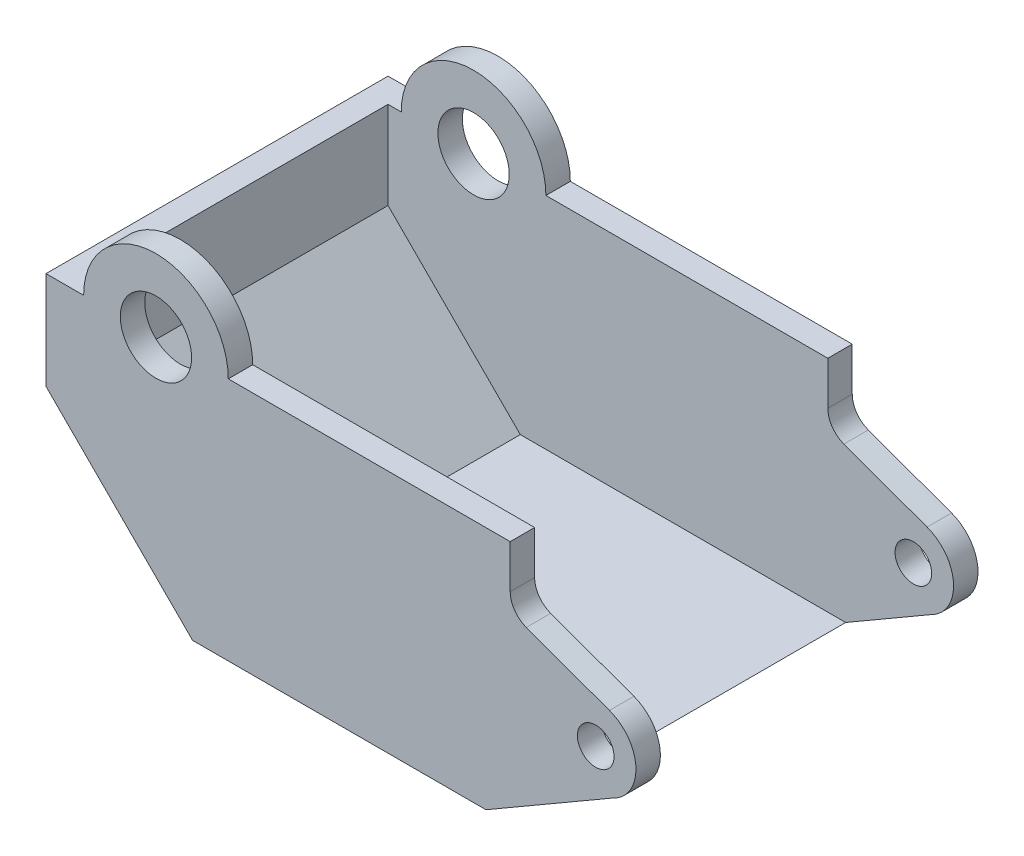
ISO-10303-21;
HEADER;
FILE_DESCRIPTION(('STEP AP214'),'2;1');
FILE_NAME('part.step','',(''),(''),'','','');
FILE_SCHEMA(('AUTOMOTIVE_DESIGN { 1 0 10303 214 1 1 1 1 }'));
ENDSEC;
DATA;
#1=APPLICATION_CONTEXT('core data for automotive mechanical design processes');
#2=APPLICATION_PROTOCOL_DEFINITION('international standard','automotive_design',2000,#1);
#3=PRODUCT_CONTEXT('',#1,'mechanical');
#4=PRODUCT('Part','Part','',(#3));
#5=PRODUCT_RELATED_PRODUCT_CATEGORY('part','',(#4));
#6=PRODUCT_DEFINITION_FORMATION('','',#4);
#7=PRODUCT_DEFINITION_CONTEXT('part definition',#1,'design');
#8=PRODUCT_DEFINITION('design','',#6,#7);
#9=PRODUCT_DEFINITION_SHAPE('','',#8);
#10=(LENGTH_UNIT() NAMED_UNIT(*) SI_UNIT(.MILLI.,.METRE.));
#11=(NAMED_UNIT(*) PLANE_ANGLE_UNIT() SI_UNIT($,.RADIAN.));
#12=(NAMED_UNIT(*) SI_UNIT($,.STERADIAN.) SOLID_ANGLE_UNIT());
#13=UNCERTAINTY_MEASURE_WITH_UNIT(LENGTH_MEASURE(1.E-05),#10,'distance_accuracy_value','');
#14=(GEOMETRIC_REPRESENTATION_CONTEXT(3) GLOBAL_UNCERTAINTY_ASSIGNED_CONTEXT((#13)) GLOBAL_UNIT_ASSIGNED_CONTEXT((#10,
#11,#12)) REPRESENTATION_CONTEXT('',''));
#15=CARTESIAN_POINT('',(0.,0.,0.));
#16=DIRECTION('',(0.,0.,1.));
#17=DIRECTION('',(1.,0.,0.));
#18=AXIS2_PLACEMENT_3D('',#15,#16,#17);
#19=CARTESIAN_POINT('',(-13.0946184312274,7.88158143332714,22.58314));
#20=DIRECTION('',(0.,0.,-1.));
#21=DIRECTION('',(-1.,0.,0.));
#22=AXIS2_PLACEMENT_3D('',#19,#20,#21);
#23=CYLINDRICAL_SURFACE('',#22,4.7752);
#24=CARTESIAN_POINT('',(-13.0946184312274,7.88158143332714,1.6129));
#25=DIRECTION('',(0.,0.,1.));
#26=DIRECTION('',(1.,0.,0.));
#27=AXIS2_PLACEMENT_3D('',#24,#25,#26);
#28=CIRCLE('',#27,4.7752);
#29=CARTESIAN_POINT('',(-8.31941843122745,7.88158143332714,1.6129));
#30=VERTEX_POINT('',#29);
#31=CARTESIAN_POINT('',(-17.8698184312274,7.88158143332714,1.6129));
#32=VERTEX_POINT('',#31);
#33=EDGE_CURVE('E227',#30,#32,#28,.T.);
#34=ORIENTED_EDGE('',*,*,#33,.F.);
#35=DIRECTION('',(0.,0.,-1.));
#36=VECTOR('',#35,1.);
#37=CARTESIAN_POINT('',(-8.31941843122745,7.88158143332714,22.58314));
#38=LINE('',#37,#36);
#39=CARTESIAN_POINT('',(-8.31941843122745,7.88158143332714,0.));
#40=VERTEX_POINT('',#39);
#41=EDGE_CURVE('E101',#30,#40,#38,.T.);
#42=ORIENTED_EDGE('',*,*,#41,.T.);
#43=CARTESIAN_POINT('',(-13.0946184312274,7.88158143332714,0.));
#44=DIRECTION('',(0.,0.,1.));
#45=DIRECTION('',(1.,0.,0.));
#46=AXIS2_PLACEMENT_3D('',#43,#44,#45);
#47=CIRCLE('',#46,4.7752);
#48=CARTESIAN_POINT('',(-17.8698184312274,7.88158143332714,0.));
#49=VERTEX_POINT('',#48);
#50=EDGE_CURVE('E165',#40,#49,#47,.T.);
#51=ORIENTED_EDGE('',*,*,#50,.T.);
#52=DIRECTION('',(0.,0.,-1.));
#53=VECTOR('',#52,1.);
#54=CARTESIAN_POINT('',(-17.8698184312274,7.88158143332714,22.58314));
#55=LINE('',#54,#53);
#56=EDGE_CURVE('E41',#32,#49,#55,.T.);
#57=ORIENTED_EDGE('',*,*,#56,.F.);
#58=EDGE_LOOP('',(#34,#42,#51,#57));
#59=FACE_BOUND('',#58,.T.);
#60=ADVANCED_FACE('F32',(#59),#23,.T.);
#61=CARTESIAN_POINT('',(-17.8698184312274,7.88158143332714,22.58314));
#62=DIRECTION('',(0.,-1.,0.));
#63=DIRECTION('',(1.,0.,0.));
#64=AXIS2_PLACEMENT_3D('',#61,#62,#63);
#65=PLANE('',#64);
#66=DIRECTION('',(-1.,0.,0.));
#67=VECTOR('',#66,1.);
#68=CARTESIAN_POINT('',(-17.8698184312274,7.88158143332714,1.6129));
#69=LINE('',#68,#67);
#70=CARTESIAN_POINT('',(-18.7410384312274,7.88158143332714,1.6129));
#71=VERTEX_POINT('',#70);
#72=EDGE_CURVE('E244',#32,#71,#69,.T.);
#73=ORIENTED_EDGE('',*,*,#72,.F.);
#74=ORIENTED_EDGE('',*,*,#56,.T.);
#75=DIRECTION('',(-1.,0.,0.));
#76=VECTOR('',#75,1.);
#77=CARTESIAN_POINT('',(-17.8698184312274,7.88158143332714,0.));
#78=LINE('',#77,#76);
#79=CARTESIAN_POINT('',(-20.3539384312274,7.88158143332714,0.));
#80=VERTEX_POINT('',#79);
#81=EDGE_CURVE('E167',#49,#80,#78,.T.);
#82=ORIENTED_EDGE('',*,*,#81,.T.);
#83=DIRECTION('',(0.,0.,-1.));
#84=VECTOR('',#83,1.);
#85=CARTESIAN_POINT('',(-20.3539384312274,7.88158143332714,22.58314));
#86=LINE('',#85,#84);
#87=CARTESIAN_POINT('',(-20.3539384312274,7.88158143332714,22.58314));
#88=VERTEX_POINT('',#87);
#89=EDGE_CURVE('E218',#88,#80,#86,.T.);
#90=ORIENTED_EDGE('',*,*,#89,.F.);
#91=DIRECTION('',(-1.,0.,0.));
#92=VECTOR('',#91,1.);
#93=CARTESIAN_POINT('',(-17.8698184312274,7.88158143332714,22.58314));
#94=LINE('',#93,#92);
#95=CARTESIAN_POINT('',(-17.8698184312274,7.88158143332714,22.58314));
#96=VERTEX_POINT('',#95);
#97=EDGE_CURVE('E109',#96,#88,#94,.T.);
#98=ORIENTED_EDGE('',*,*,#97,.F.);
#99=CARTESIAN_POINT('',(-17.8698184312274,7.88158143332714,20.97024));
#100=VERTEX_POINT('',#99);
#101=EDGE_CURVE('E11',#96,#100,#55,.T.);
#102=ORIENTED_EDGE('',*,*,#101,.T.);
#103=DIRECTION('',(-1.,0.,0.));
#104=VECTOR('',#103,1.);
#105=CARTESIAN_POINT('',(-17.8698184312274,7.88158143332714,20.97024));
#106=LINE('',#105,#104);
#107=CARTESIAN_POINT('',(-18.7410384312274,7.88158143332714,20.97024));
#108=VERTEX_POINT('',#107);
#109=EDGE_CURVE('E253',#100,#108,#106,.T.);
#110=ORIENTED_EDGE('',*,*,#109,.T.);
#111=DIRECTION('',(0.,0.,-1.));
#112=VECTOR('',#111,1.);
#113=CARTESIAN_POINT('',(-18.7410384312274,7.88158143332714,22.58314));
#114=LINE('',#113,#112);
#115=EDGE_CURVE('E168',#108,#71,#114,.T.);
#116=ORIENTED_EDGE('',*,*,#115,.T.);
#117=EDGE_LOOP('',(#73,#74,#82,#90,#98,#102,#110,#116));
#118=FACE_BOUND('',#117,.T.);
#119=ADVANCED_FACE('F381',(#118),#65,.F.);
#120=CARTESIAN_POINT('',(17.0469705881145,-3.40594062523762,22.58314));
#121=DIRECTION('',(-0.50163211065543,0.865081051439331,0.));
#122=DIRECTION('',(-0.865081051439331,-0.50163211065543,0.));
#123=AXIS2_PLACEMENT_3D('',#120,#121,#122);
#124=PLANE('',#123);
#125=DIRECTION('',(0.865081051439331,0.50163211065543,0.));
#126=VECTOR('',#125,1.);
#127=CARTESIAN_POINT('',(17.0469705881145,-3.40594062523762,1.6129));
#128=LINE('',#127,#126);
#129=CARTESIAN_POINT('',(11.4748015687726,-6.63705856667286,1.6129));
#130=VERTEX_POINT('',#129);
#131=CARTESIAN_POINT('',(17.0469705881145,-3.40594062523762,1.6129));
#132=VERTEX_POINT('',#131);
#133=EDGE_CURVE('E265',#130,#132,#128,.T.);
#134=ORIENTED_EDGE('',*,*,#133,.F.);
#135=DIRECTION('',(0.,0.,-1.));
#136=VECTOR('',#135,1.);
#137=CARTESIAN_POINT('',(11.4748015687726,-6.63705856667286,22.58314));
#138=LINE('',#137,#136);
#139=CARTESIAN_POINT('',(11.4748015687726,-6.63705856667286,20.97024));
#140=VERTEX_POINT('',#139);
#141=EDGE_CURVE('E259',#140,#130,#138,.T.);
#142=ORIENTED_EDGE('',*,*,#141,.F.);
#143=DIRECTION('',(0.865081051439331,0.50163211065543,0.));
#144=VECTOR('',#143,1.);
#145=CARTESIAN_POINT('',(17.0469705881145,-3.40594062523762,20.97024));
#146=LINE('',#145,#144);
#147=CARTESIAN_POINT('',(17.0469705881145,-3.40594062523762,20.97024));
#148=VERTEX_POINT('',#147);
#149=EDGE_CURVE('E268',#140,#148,#146,.T.);
#150=ORIENTED_EDGE('',*,*,#149,.T.);
#151=DIRECTION('',(0.,0.,-1.));
#152=VECTOR('',#151,1.);
#153=CARTESIAN_POINT('',(17.0469705881145,-3.40594062523762,22.58314));
#154=LINE('',#153,#152);
#155=CARTESIAN_POINT('',(17.0469705881145,-3.40594062523762,22.58314));
#156=VERTEX_POINT('',#155);
#157=EDGE_CURVE('E206',#156,#148,#154,.T.);
#158=ORIENTED_EDGE('',*,*,#157,.F.);
#159=DIRECTION('',(0.865081051439331,0.50163211065543,0.));
#160=VECTOR('',#159,1.);
#161=CARTESIAN_POINT('',(17.0469705881145,-3.40594062523762,22.58314));
#162=LINE('',#161,#160);
#163=CARTESIAN_POINT('',(8.69330254144071,-8.24995856667286,22.58314));
#164=VERTEX_POINT('',#163);
#165=EDGE_CURVE('E318',#164,#156,#162,.T.);
#166=ORIENTED_EDGE('',*,*,#165,.F.);
#167=DIRECTION('',(0.,0.,-1.));
#168=VECTOR('',#167,1.);
#169=CARTESIAN_POINT('',(8.69330254144071,-8.24995856667286,22.58314));
#170=LINE('',#169,#168);
#171=CARTESIAN_POINT('',(8.69330254144071,-8.24995856667286,0.));
#172=VERTEX_POINT('',#171);
#173=EDGE_CURVE('E209',#164,#172,#170,.T.);
#174=ORIENTED_EDGE('',*,*,#173,.T.);
#175=DIRECTION('',(0.865081051439331,0.50163211065543,0.));
#176=VECTOR('',#175,1.);
#177=CARTESIAN_POINT('',(17.0469705881145,-3.40594062523762,0.));
#178=LINE('',#177,#176);
#179=CARTESIAN_POINT('',(17.0469705881145,-3.40594062523762,0.));
#180=VERTEX_POINT('',#179);
#181=EDGE_CURVE('E176',#172,#180,#178,.T.);
#182=ORIENTED_EDGE('',*,*,#181,.T.);
#183=EDGE_CURVE('E205',#132,#180,#154,.T.);
#184=ORIENTED_EDGE('',*,*,#183,.F.);
#185=EDGE_LOOP('',(#134,#142,#150,#158,#166,#174,#182,#184));
#186=FACE_BOUND('',#185,.T.);
#187=ADVANCED_FACE('F399',(#186),#124,.F.);
#188=CARTESIAN_POINT('',(15.9401215687726,-0.990638566672863,22.58314));
#189=DIRECTION('',(0.,0.,-1.));
#190=DIRECTION('',(-1.,0.,0.));
#191=AXIS2_PLACEMENT_3D('',#188,#189,#190);
#192=CYLINDRICAL_SURFACE('',#191,2.65684000002358);
#193=CARTESIAN_POINT('',(15.9401215687726,-0.990638566672863,1.6129));
#194=DIRECTION('',(0.,0.,1.));
#195=DIRECTION('',(1.,0.,0.));
#196=AXIS2_PLACEMENT_3D('',#193,#194,#195);
#197=CIRCLE('',#196,2.65684000002358);
#198=CARTESIAN_POINT('',(16.8489493410234,1.50592524507138,1.6129));
#199=VERTEX_POINT('',#198);
#200=EDGE_CURVE('E292',#132,#199,#197,.T.);
#201=ORIENTED_EDGE('',*,*,#200,.F.);
#202=ORIENTED_EDGE('',*,*,#183,.T.);
#203=CARTESIAN_POINT('',(15.9401215687726,-0.990638566672863,0.));
#204=DIRECTION('',(0.,0.,1.));
#205=DIRECTION('',(1.,0.,0.));
#206=AXIS2_PLACEMENT_3D('',#203,#204,#205);
#207=CIRCLE('',#206,2.65684000002358);
#208=CARTESIAN_POINT('',(16.8489493410234,1.50592524507138,0.));
#209=VERTEX_POINT('',#208);
#210=EDGE_CURVE('E179',#180,#209,#207,.T.);
#211=ORIENTED_EDGE('',*,*,#210,.T.);
#212=DIRECTION('',(0.,0.,-1.));
#213=VECTOR('',#212,1.);
#214=CARTESIAN_POINT('',(16.8489493410234,1.50592524507138,22.58314));
#215=LINE('',#214,#213);
#216=EDGE_CURVE('E201',#199,#209,#215,.T.);
#217=ORIENTED_EDGE('',*,*,#216,.F.);
#218=EDGE_LOOP('',(#201,#202,#211,#217));
#219=FACE_BOUND('',#218,.T.);
#220=ADVANCED_FACE('F426',(#219),#192,.T.);
#221=CARTESIAN_POINT('',(11.3548753399254,3.50594103137348,22.58314));
#222=DIRECTION('',(-0.342070946027142,-0.939674128559521,0.));
#223=DIRECTION('',(0.939674128559521,-0.342070946027143,0.));
#224=AXIS2_PLACEMENT_3D('',#221,#222,#223);
#225=PLANE('',#224);
#226=DIRECTION('',(-0.939674128559521,0.342070946027143,0.));
#227=VECTOR('',#226,1.);
#228=CARTESIAN_POINT('',(11.3548753399254,3.50594103137348,1.6129));
#229=LINE('',#228,#227);
#230=CARTESIAN_POINT('',(11.3548753399254,3.50594103137348,1.6129));
#231=VERTEX_POINT('',#230);
#232=EDGE_CURVE('E295',#199,#231,#229,.T.);
#233=ORIENTED_EDGE('',*,*,#232,.F.);
#234=ORIENTED_EDGE('',*,*,#216,.T.);
#235=DIRECTION('',(-0.939674128559521,0.342070946027142,0.));
#236=VECTOR('',#235,1.);
#237=CARTESIAN_POINT('',(11.3548753399254,3.50594103137348,0.));
#238=LINE('',#237,#236);
#239=CARTESIAN_POINT('',(11.3548753399254,3.50594103137348,0.));
#240=VERTEX_POINT('',#239);
#241=EDGE_CURVE('E182',#209,#240,#238,.T.);
#242=ORIENTED_EDGE('',*,*,#241,.T.);
#243=DIRECTION('',(0.,0.,-1.));
#244=VECTOR('',#243,1.);
#245=CARTESIAN_POINT('',(11.3548753399254,3.50594103137348,22.58314));
#246=LINE('',#245,#244);
#247=EDGE_CURVE('E155',#231,#240,#246,.T.);
#248=ORIENTED_EDGE('',*,*,#247,.F.);
#249=EDGE_LOOP('',(#233,#234,#242,#248));
#250=FACE_BOUND('',#249,.T.);
#251=ADVANCED_FACE('F433',(#250),#225,.F.);
#252=CARTESIAN_POINT('',(11.9066015687726,5.02154143332714,22.58314));
#253=DIRECTION('',(0.,0.,-1.));
#254=DIRECTION('',(-1.,0.,0.));
#255=AXIS2_PLACEMENT_3D('',#252,#253,#254);
#256=CYLINDRICAL_SURFACE('',#255,1.6129);
#257=CARTESIAN_POINT('',(11.9066015687726,5.02154143332714,1.6129));
#258=DIRECTION('',(0.,0.,1.));
#259=DIRECTION('',(1.,0.,0.));
#260=AXIS2_PLACEMENT_3D('',#257,#258,#259);
#261=CIRCLE('',#260,1.6129);
#262=CARTESIAN_POINT('',(10.2937015687726,5.02154143332714,1.6129));
#263=VERTEX_POINT('',#262);
#264=EDGE_CURVE('E298',#231,#263,#261,.F.);
#265=ORIENTED_EDGE('',*,*,#264,.F.);
#266=ORIENTED_EDGE('',*,*,#247,.T.);
#267=CARTESIAN_POINT('',(11.9066015687726,5.02154143332714,0.));
#268=DIRECTION('',(0.,0.,-1.));
#269=DIRECTION('',(1.,0.,0.));
#270=AXIS2_PLACEMENT_3D('',#267,#268,#269);
#271=CIRCLE('',#270,1.6129);
#272=CARTESIAN_POINT('',(10.2937015687726,5.02154143332714,0.));
#273=VERTEX_POINT('',#272);
#274=EDGE_CURVE('E185',#240,#273,#271,.T.);
#275=ORIENTED_EDGE('',*,*,#274,.T.);
#276=DIRECTION('',(0.,0.,-1.));
#277=VECTOR('',#276,1.);
#278=CARTESIAN_POINT('',(10.2937015687726,5.02154143332714,22.58314));
#279=LINE('',#278,#277);
#280=EDGE_CURVE('E156',#263,#273,#279,.T.);
#281=ORIENTED_EDGE('',*,*,#280,.F.);
#282=EDGE_LOOP('',(#265,#266,#275,#281));
#283=FACE_BOUND('',#282,.T.);
#284=ADVANCED_FACE('F436',(#283),#256,.F.);
#285=CARTESIAN_POINT('',(10.2937015687726,7.88158143332714,22.58314));
#286=DIRECTION('',(-1.,0.,0.));
#287=DIRECTION('',(0.,0.,1.));
#288=AXIS2_PLACEMENT_3D('',#285,#286,#287);
#289=PLANE('',#288);
#290=DIRECTION('',(0.,1.,0.));
#291=VECTOR('',#290,1.);
#292=CARTESIAN_POINT('',(10.2937015687726,7.88158143332714,1.6129));
#293=LINE('',#292,#291);
#294=CARTESIAN_POINT('',(10.2937015687726,7.88158143332714,1.6129));
#295=VERTEX_POINT('',#294);
#296=EDGE_CURVE('E301',#263,#295,#293,.T.);
#297=ORIENTED_EDGE('',*,*,#296,.F.);
#298=ORIENTED_EDGE('',*,*,#280,.T.);
#299=DIRECTION('',(0.,1.,0.));
#300=VECTOR('',#299,1.);
#301=CARTESIAN_POINT('',(10.2937015687726,7.88158143332714,0.));
#302=LINE('',#301,#300);
#303=CARTESIAN_POINT('',(10.2937015687726,7.88158143332714,0.));
#304=VERTEX_POINT('',#303);
#305=EDGE_CURVE('E188',#273,#304,#302,.T.);
#306=ORIENTED_EDGE('',*,*,#305,.T.);
#307=DIRECTION('',(0.,0.,-1.));
#308=VECTOR('',#307,1.);
#309=CARTESIAN_POINT('',(10.2937015687726,7.88158143332714,22.58314));
#310=LINE('',#309,#308);
#311=EDGE_CURVE('E197',#295,#304,#310,.T.);
#312=ORIENTED_EDGE('',*,*,#311,.F.);
#313=EDGE_LOOP('',(#297,#298,#306,#312));
#314=FACE_BOUND('',#313,.T.);
#315=ADVANCED_FACE('F442',(#314),#289,.F.);
#316=CARTESIAN_POINT('',(-8.31941843122745,7.88158143332714,22.58314));
#317=DIRECTION('',(0.,-1.,0.));
#318=DIRECTION('',(0.,0.,-1.));
#319=AXIS2_PLACEMENT_3D('',#316,#317,#318);
#320=PLANE('',#319);
#321=DIRECTION('',(-1.,0.,0.));
#322=VECTOR('',#321,1.);
#323=CARTESIAN_POINT('',(-8.31941843122745,7.88158143332714,1.6129));
#324=LINE('',#323,#322);
#325=EDGE_CURVE('E274',#295,#30,#324,.T.);
#326=ORIENTED_EDGE('',*,*,#325,.F.);
#327=ORIENTED_EDGE('',*,*,#311,.T.);
#328=DIRECTION('',(-1.,0.,0.));
#329=VECTOR('',#328,1.);
#330=CARTESIAN_POINT('',(-8.31941843122745,7.88158143332714,0.));
#331=LINE('',#330,#329);
#332=EDGE_CURVE('E191',#304,#40,#331,.T.);
#333=ORIENTED_EDGE('',*,*,#332,.T.);
#334=ORIENTED_EDGE('',*,*,#41,.F.);
#335=EDGE_LOOP('',(#326,#327,#333,#334));
#336=FACE_BOUND('',#335,.T.);
#337=ADVANCED_FACE('F444',(#336),#320,.F.);
#338=CARTESIAN_POINT('',(-8.31941843122745,7.88158143332714,22.58314));
#339=VERTEX_POINT('',#338);
#340=CARTESIAN_POINT('',(-8.31941843122745,7.88158143332714,20.97024));
#341=VERTEX_POINT('',#340);
#342=EDGE_CURVE('E194',#339,#341,#38,.T.);
#343=ORIENTED_EDGE('',*,*,#342,.T.);
#344=CARTESIAN_POINT('',(-13.0946184312274,7.88158143332714,20.97024));
#345=DIRECTION('',(0.,0.,1.));
#346=DIRECTION('',(1.,0.,0.));
#347=AXIS2_PLACEMENT_3D('',#344,#345,#346);
#348=CIRCLE('',#347,4.7752);
#349=EDGE_CURVE('E49',#341,#100,#348,.T.);
#350=ORIENTED_EDGE('',*,*,#349,.T.);
#351=ORIENTED_EDGE('',*,*,#101,.F.);
#352=CARTESIAN_POINT('',(-13.0946184312274,7.88158143332714,22.58314));
#353=DIRECTION('',(0.,0.,1.));
#354=DIRECTION('',(1.,0.,0.));
#355=AXIS2_PLACEMENT_3D('',#352,#353,#354);
#356=CIRCLE('',#355,4.7752);
#357=EDGE_CURVE('E193',#339,#96,#356,.T.);
#358=ORIENTED_EDGE('',*,*,#357,.F.);
#359=EDGE_LOOP('',(#343,#350,#351,#358));
#360=FACE_BOUND('',#359,.T.);
#361=ADVANCED_FACE('F34',(#360),#23,.T.);
#362=CARTESIAN_POINT('',(-20.3539384312274,7.88158143332714,22.58314));
#363=DIRECTION('',(1.,0.,0.));
#364=DIRECTION('',(0.,0.,-1.));
#365=AXIS2_PLACEMENT_3D('',#362,#363,#364);
#366=PLANE('',#365);
#367=DIRECTION('',(0.,-1.,0.));
#368=VECTOR('',#367,1.);
#369=CARTESIAN_POINT('',(-20.3539384312274,7.88158143332714,0.));
#370=LINE('',#369,#368);
#371=CARTESIAN_POINT('',(-20.3539384312274,1.42998143332714,0.));
#372=VERTEX_POINT('',#371);
#373=EDGE_CURVE('E170',#80,#372,#370,.T.);
#374=ORIENTED_EDGE('',*,*,#373,.T.);
#375=DIRECTION('',(0.,0.,-1.));
#376=VECTOR('',#375,1.);
#377=CARTESIAN_POINT('',(-20.3539384312274,1.42998143332714,22.58314));
#378=LINE('',#377,#376);
#379=CARTESIAN_POINT('',(-20.3539384312274,1.42998143332714,22.58314));
#380=VERTEX_POINT('',#379);
#381=EDGE_CURVE('E215',#380,#372,#378,.T.);
#382=ORIENTED_EDGE('',*,*,#381,.F.);
#383=DIRECTION('',(0.,-1.,0.));
#384=VECTOR('',#383,1.);
#385=CARTESIAN_POINT('',(-20.3539384312274,7.88158143332714,22.58314));
#386=LINE('',#385,#384);
#387=EDGE_CURVE('E312',#88,#380,#386,.T.);
#388=ORIENTED_EDGE('',*,*,#387,.F.);
#389=ORIENTED_EDGE('',*,*,#89,.T.);
#390=EDGE_LOOP('',(#374,#382,#388,#389));
#391=FACE_BOUND('',#390,.T.);
#392=ADVANCED_FACE('F385',(#391),#366,.F.);
#393=CARTESIAN_POINT('',(-20.3539384312274,1.42998143332714,22.58314));
#394=DIRECTION('',(0.707199559087493,0.707013991110824,0.));
#395=DIRECTION('',(-0.707013991110824,0.707199559087493,0.));
#396=AXIS2_PLACEMENT_3D('',#393,#394,#395);
#397=PLANE('',#396);
#398=DIRECTION('',(0.707013991110824,-0.707199559087493,0.));
#399=VECTOR('',#398,1.);
#400=CARTESIAN_POINT('',(-20.3539384312274,1.42998143332714,0.));
#401=LINE('',#400,#399);
#402=CARTESIAN_POINT('',(-10.6765384312274,-8.24995856667286,0.));
#403=VERTEX_POINT('',#402);
#404=EDGE_CURVE('E172',#372,#403,#401,.T.);
#405=ORIENTED_EDGE('',*,*,#404,.T.);
#406=DIRECTION('',(0.,0.,-1.));
#407=VECTOR('',#406,1.);
#408=CARTESIAN_POINT('',(-10.6765384312274,-8.24995856667286,22.58314));
#409=LINE('',#408,#407);
#410=CARTESIAN_POINT('',(-10.6765384312274,-8.24995856667286,22.58314));
#411=VERTEX_POINT('',#410);
#412=EDGE_CURVE('E212',#411,#403,#409,.T.);
#413=ORIENTED_EDGE('',*,*,#412,.F.);
#414=DIRECTION('',(0.707013991110824,-0.707199559087493,0.));
#415=VECTOR('',#414,1.);
#416=CARTESIAN_POINT('',(-20.3539384312274,1.42998143332714,22.58314));
#417=LINE('',#416,#415);
#418=EDGE_CURVE('E314',#380,#411,#417,.T.);
#419=ORIENTED_EDGE('',*,*,#418,.F.);
#420=ORIENTED_EDGE('',*,*,#381,.T.);
#421=EDGE_LOOP('',(#405,#413,#419,#420));
#422=FACE_BOUND('',#421,.T.);
#423=ADVANCED_FACE('F390',(#422),#397,.F.);
#424=CARTESIAN_POINT('',(-10.6765384312274,-8.24995856667286,22.58314));
#425=DIRECTION('',(0.,1.,0.));
#426=DIRECTION('',(-1.,0.,0.));
#427=AXIS2_PLACEMENT_3D('',#424,#425,#426);
#428=PLANE('',#427);
#429=DIRECTION('',(1.,0.,0.));
#430=VECTOR('',#429,1.);
#431=CARTESIAN_POINT('',(-10.6765384312274,-8.24995856667286,0.));
#432=LINE('',#431,#430);
#433=EDGE_CURVE('E174',#403,#172,#432,.T.);
#434=ORIENTED_EDGE('',*,*,#433,.T.);
#435=ORIENTED_EDGE('',*,*,#173,.F.);
#436=DIRECTION('',(1.,0.,0.));
#437=VECTOR('',#436,1.);
#438=CARTESIAN_POINT('',(-10.6765384312274,-8.24995856667286,22.58314));
#439=LINE('',#438,#437);
#440=EDGE_CURVE('E316',#411,#164,#439,.T.);
#441=ORIENTED_EDGE('',*,*,#440,.F.);
#442=ORIENTED_EDGE('',*,*,#412,.T.);
#443=EDGE_LOOP('',(#434,#435,#441,#442));
#444=FACE_BOUND('',#443,.T.);
#445=ADVANCED_FACE('F394',(#444),#428,.F.);
#446=ORIENTED_EDGE('',*,*,#157,.T.);
#447=CARTESIAN_POINT('',(15.9401215687726,-0.990638566672863,20.97024));
#448=DIRECTION('',(0.,0.,1.));
#449=DIRECTION('',(1.,0.,0.));
#450=AXIS2_PLACEMENT_3D('',#447,#448,#449);
#451=CIRCLE('',#450,2.65684000002358);
#452=CARTESIAN_POINT('',(16.8489493410234,1.50592524507138,20.97024));
#453=VERTEX_POINT('',#452);
#454=EDGE_CURVE('E283',#148,#453,#451,.T.);
#455=ORIENTED_EDGE('',*,*,#454,.T.);
#456=CARTESIAN_POINT('',(16.8489493410234,1.50592524507138,22.58314));
#457=VERTEX_POINT('',#456);
#458=EDGE_CURVE('E202',#457,#453,#215,.T.);
#459=ORIENTED_EDGE('',*,*,#458,.F.);
#460=CARTESIAN_POINT('',(15.9401215687726,-0.990638566672863,22.58314));
#461=DIRECTION('',(0.,0.,1.));
#462=DIRECTION('',(1.,0.,0.));
#463=AXIS2_PLACEMENT_3D('',#460,#461,#462);
#464=CIRCLE('',#463,2.65684000002358);
#465=EDGE_CURVE('E320',#156,#457,#464,.T.);
#466=ORIENTED_EDGE('',*,*,#465,.F.);
#467=EDGE_LOOP('',(#446,#455,#459,#466));
#468=FACE_BOUND('',#467,.T.);
#469=ADVANCED_FACE('F326',(#468),#192,.T.);
#470=ORIENTED_EDGE('',*,*,#458,.T.);
#471=DIRECTION('',(-0.939674128559521,0.342070946027143,0.));
#472=VECTOR('',#471,1.);
#473=CARTESIAN_POINT('',(11.3548753399254,3.50594103137348,20.97024));
#474=LINE('',#473,#472);
#475=CARTESIAN_POINT('',(11.3548753399254,3.50594103137348,20.97024));
#476=VERTEX_POINT('',#475);
#477=EDGE_CURVE('E280',#453,#476,#474,.T.);
#478=ORIENTED_EDGE('',*,*,#477,.T.);
#479=CARTESIAN_POINT('',(11.3548753399254,3.50594103137348,22.58314));
#480=VERTEX_POINT('',#479);
#481=EDGE_CURVE('E199',#480,#476,#246,.T.);
#482=ORIENTED_EDGE('',*,*,#481,.F.);
#483=DIRECTION('',(-0.939674128559521,0.342070946027142,0.));
#484=VECTOR('',#483,1.);
#485=CARTESIAN_POINT('',(11.3548753399254,3.50594103137348,22.58314));
#486=LINE('',#485,#484);
#487=EDGE_CURVE('E141',#457,#480,#486,.T.);
#488=ORIENTED_EDGE('',*,*,#487,.F.);
#489=EDGE_LOOP('',(#470,#478,#482,#488));
#490=FACE_BOUND('',#489,.T.);
#491=ADVANCED_FACE('F330',(#490),#225,.F.);
#492=ORIENTED_EDGE('',*,*,#481,.T.);
#493=CARTESIAN_POINT('',(11.9066015687726,5.02154143332714,20.97024));
#494=DIRECTION('',(0.,0.,1.));
#495=DIRECTION('',(1.,0.,0.));
#496=AXIS2_PLACEMENT_3D('',#493,#494,#495);
#497=CIRCLE('',#496,1.6129);
#498=CARTESIAN_POINT('',(10.2937015687726,5.02154143332714,20.97024));
#499=VERTEX_POINT('',#498);
#500=EDGE_CURVE('E152',#476,#499,#497,.F.);
#501=ORIENTED_EDGE('',*,*,#500,.T.);
#502=CARTESIAN_POINT('',(10.2937015687726,5.02154143332714,22.58314));
#503=VERTEX_POINT('',#502);
#504=EDGE_CURVE('E148',#503,#499,#279,.T.);
#505=ORIENTED_EDGE('',*,*,#504,.F.);
#506=CARTESIAN_POINT('',(11.9066015687726,5.02154143332714,22.58314));
#507=DIRECTION('',(0.,0.,-1.));
#508=DIRECTION('',(1.,0.,0.));
#509=AXIS2_PLACEMENT_3D('',#506,#507,#508);
#510=CIRCLE('',#509,1.6129);
#511=EDGE_CURVE('E134',#480,#503,#510,.T.);
#512=ORIENTED_EDGE('',*,*,#511,.F.);
#513=EDGE_LOOP('',(#492,#501,#505,#512));
#514=FACE_BOUND('',#513,.T.);
#515=ADVANCED_FACE('F149',(#514),#256,.F.);
#516=ORIENTED_EDGE('',*,*,#504,.T.);
#517=DIRECTION('',(0.,1.,0.));
#518=VECTOR('',#517,1.);
#519=CARTESIAN_POINT('',(10.2937015687726,7.88158143332714,20.97024));
#520=LINE('',#519,#518);
#521=CARTESIAN_POINT('',(10.2937015687726,7.88158143332714,20.97024));
#522=VERTEX_POINT('',#521);
#523=EDGE_CURVE('E277',#499,#522,#520,.T.);
#524=ORIENTED_EDGE('',*,*,#523,.T.);
#525=CARTESIAN_POINT('',(10.2937015687726,7.88158143332714,22.58314));
#526=VERTEX_POINT('',#525);
#527=EDGE_CURVE('E160',#526,#522,#310,.T.);
#528=ORIENTED_EDGE('',*,*,#527,.F.);
#529=DIRECTION('',(0.,1.,0.));
#530=VECTOR('',#529,1.);
#531=CARTESIAN_POINT('',(10.2937015687726,7.88158143332714,22.58314));
#532=LINE('',#531,#530);
#533=EDGE_CURVE('E138',#503,#526,#532,.T.);
#534=ORIENTED_EDGE('',*,*,#533,.F.);
#535=EDGE_LOOP('',(#516,#524,#528,#534));
#536=FACE_BOUND('',#535,.T.);
#537=ADVANCED_FACE('F158',(#536),#289,.F.);
#538=ORIENTED_EDGE('',*,*,#527,.T.);
#539=DIRECTION('',(-1.,0.,0.));
#540=VECTOR('',#539,1.);
#541=CARTESIAN_POINT('',(-8.31941843122745,7.88158143332714,20.97024));
#542=LINE('',#541,#540);
#543=EDGE_CURVE('E275',#522,#341,#542,.T.);
#544=ORIENTED_EDGE('',*,*,#543,.T.);
#545=ORIENTED_EDGE('',*,*,#342,.F.);
#546=DIRECTION('',(-1.,0.,0.));
#547=VECTOR('',#546,1.);
#548=CARTESIAN_POINT('',(-8.31941843122745,7.88158143332714,22.58314));
#549=LINE('',#548,#547);
#550=EDGE_CURVE('E58',#526,#339,#549,.T.);
#551=ORIENTED_EDGE('',*,*,#550,.F.);
#552=EDGE_LOOP('',(#538,#544,#545,#551));
#553=FACE_BOUND('',#552,.T.);
#554=ADVANCED_FACE('F375',(#553),#320,.F.);
#555=CARTESIAN_POINT('',(-13.0946184312274,7.88158143332714,22.58314));
#556=DIRECTION('',(0.,0.,1.));
#557=DIRECTION('',(1.,0.,0.));
#558=AXIS2_PLACEMENT_3D('',#555,#556,#557);
#559=PLANE('',#558);
#560=CARTESIAN_POINT('',(15.9401215687726,-0.990638566672863,22.58314));
#561=DIRECTION('',(0.,0.,1.));
#562=DIRECTION('',(1.,0.,0.));
#563=AXIS2_PLACEMENT_3D('',#560,#561,#562);
#564=CIRCLE('',#563,1.20904);
#565=CARTESIAN_POINT('',(17.1491615687726,-0.990638566672863,22.58314));
#566=VERTEX_POINT('',#565);
#567=EDGE_CURVE('E673',#566,#566,#564,.T.);
#568=ORIENTED_EDGE('',*,*,#567,.F.);
#569=EDGE_LOOP('',(#568));
#570=FACE_BOUND('',#569,.T.);
#571=CARTESIAN_POINT('',(-13.0946184312274,7.88158143332714,22.58314));
#572=DIRECTION('',(0.,0.,1.));
#573=DIRECTION('',(1.,0.,0.));
#574=AXIS2_PLACEMENT_3D('',#571,#572,#573);
#575=CIRCLE('',#574,2.35458);
#576=CARTESIAN_POINT('',(-10.7400384312274,7.88158143332714,22.58314));
#577=VERTEX_POINT('',#576);
#578=EDGE_CURVE('E230',#577,#577,#575,.T.);
#579=ORIENTED_EDGE('',*,*,#578,.F.);
#580=EDGE_LOOP('',(#579));
#581=FACE_BOUND('',#580,.T.);
#582=ORIENTED_EDGE('',*,*,#357,.T.);
#583=ORIENTED_EDGE('',*,*,#97,.T.);
#584=ORIENTED_EDGE('',*,*,#387,.T.);
#585=ORIENTED_EDGE('',*,*,#418,.T.);
#586=ORIENTED_EDGE('',*,*,#440,.T.);
#587=ORIENTED_EDGE('',*,*,#165,.T.);
#588=ORIENTED_EDGE('',*,*,#465,.T.);
#589=ORIENTED_EDGE('',*,*,#487,.T.);
#590=ORIENTED_EDGE('',*,*,#511,.T.);
#591=ORIENTED_EDGE('',*,*,#533,.T.);
#592=ORIENTED_EDGE('',*,*,#550,.T.);
#593=EDGE_LOOP('',(#582,#583,#584,#585,#586,#587,#588,#589,#590,#591,#592));
#594=FACE_BOUND('',#593,.T.);
#595=ADVANCED_FACE('F136',(#570,#581,#594),#559,.T.);
#596=CARTESIAN_POINT('',(-13.0946184312274,7.88158143332714,0.));
#597=DIRECTION('',(0.,0.,1.));
#598=DIRECTION('',(1.,0.,0.));
#599=AXIS2_PLACEMENT_3D('',#596,#597,#598);
#600=PLANE('',#599);
#601=CARTESIAN_POINT('',(15.9401215687726,-0.990638566672863,0.));
#602=DIRECTION('',(0.,0.,1.));
#603=DIRECTION('',(1.,0.,0.));
#604=AXIS2_PLACEMENT_3D('',#601,#602,#603);
#605=CIRCLE('',#604,1.20904);
#606=CARTESIAN_POINT('',(17.1491615687726,-0.990638566672863,0.));
#607=VERTEX_POINT('',#606);
#608=EDGE_CURVE('E677',#607,#607,#605,.T.);
#609=ORIENTED_EDGE('',*,*,#608,.T.);
#610=EDGE_LOOP('',(#609));
#611=FACE_BOUND('',#610,.T.);
#612=CARTESIAN_POINT('',(-13.0946184312274,7.88158143332714,0.));
#613=DIRECTION('',(0.,0.,1.));
#614=DIRECTION('',(1.,0.,0.));
#615=AXIS2_PLACEMENT_3D('',#612,#613,#614);
#616=CIRCLE('',#615,2.35458);
#617=CARTESIAN_POINT('',(-10.7400384312274,7.88158143332714,0.));
#618=VERTEX_POINT('',#617);
#619=EDGE_CURVE('E223',#618,#618,#616,.T.);
#620=ORIENTED_EDGE('',*,*,#619,.T.);
#621=EDGE_LOOP('',(#620));
#622=FACE_BOUND('',#621,.T.);
#623=ORIENTED_EDGE('',*,*,#50,.F.);
#624=ORIENTED_EDGE('',*,*,#332,.F.);
#625=ORIENTED_EDGE('',*,*,#305,.F.);
#626=ORIENTED_EDGE('',*,*,#274,.F.);
#627=ORIENTED_EDGE('',*,*,#241,.F.);
#628=ORIENTED_EDGE('',*,*,#210,.F.);
#629=ORIENTED_EDGE('',*,*,#181,.F.);
#630=ORIENTED_EDGE('',*,*,#433,.F.);
#631=ORIENTED_EDGE('',*,*,#404,.F.);
#632=ORIENTED_EDGE('',*,*,#373,.F.);
#633=ORIENTED_EDGE('',*,*,#81,.F.);
#634=EDGE_LOOP('',(#623,#624,#625,#626,#627,#628,#629,#630,#631,#632,#633));
#635=FACE_BOUND('',#634,.T.);
#636=ADVANCED_FACE('F419',(#611,#622,#635),#600,.F.);
#637=CARTESIAN_POINT('',(-18.7410384312274,7.88158143332714,22.58314));
#638=DIRECTION('',(1.,0.,0.));
#639=DIRECTION('',(0.,0.,-1.));
#640=AXIS2_PLACEMENT_3D('',#637,#638,#639);
#641=PLANE('',#640);
#642=DIRECTION('',(0.,-1.,0.));
#643=VECTOR('',#642,1.);
#644=CARTESIAN_POINT('',(-18.7410384312274,7.88158143332714,1.6129));
#645=LINE('',#644,#643);
#646=CARTESIAN_POINT('',(-18.7410384312274,2.09794251625535,1.6129));
#647=VERTEX_POINT('',#646);
#648=EDGE_CURVE('E240',#71,#647,#645,.T.);
#649=ORIENTED_EDGE('',*,*,#648,.F.);
#650=ORIENTED_EDGE('',*,*,#115,.F.);
#651=DIRECTION('',(0.,-1.,0.));
#652=VECTOR('',#651,1.);
#653=CARTESIAN_POINT('',(-18.7410384312274,7.88158143332714,20.97024));
#654=LINE('',#653,#652);
#655=CARTESIAN_POINT('',(-18.7410384312274,2.09794251625535,20.97024));
#656=VERTEX_POINT('',#655);
#657=EDGE_CURVE('E249',#108,#656,#654,.T.);
#658=ORIENTED_EDGE('',*,*,#657,.T.);
#659=DIRECTION('',(0.,0.,-1.));
#660=VECTOR('',#659,1.);
#661=CARTESIAN_POINT('',(-18.7410384312274,2.09794251625535,22.58314));
#662=LINE('',#661,#660);
#663=EDGE_CURVE('E245',#656,#647,#662,.T.);
#664=ORIENTED_EDGE('',*,*,#663,.T.);
#665=EDGE_LOOP('',(#649,#650,#658,#664));
#666=FACE_BOUND('',#665,.T.);
#667=ADVANCED_FACE('F414',(#666),#641,.T.);
#668=CARTESIAN_POINT('',(-19.2132962623752,2.57032429958978,22.58314));
#669=DIRECTION('',(0.707199559087493,0.707013991110824,0.));
#670=DIRECTION('',(-0.707013991110824,0.707199559087493,0.));
#671=AXIS2_PLACEMENT_3D('',#668,#669,#670);
#672=PLANE('',#671);
#673=DIRECTION('',(0.707013991110824,-0.707199559087493,0.));
#674=VECTOR('',#673,1.);
#675=CARTESIAN_POINT('',(-19.2132962623752,2.57032429958978,1.6129));
#676=LINE('',#675,#674);
#677=CARTESIAN_POINT('',(-10.0083293979143,-6.63705856667286,1.6129));
#678=VERTEX_POINT('',#677);
#679=EDGE_CURVE('E243',#647,#678,#676,.T.);
#680=ORIENTED_EDGE('',*,*,#679,.F.);
#681=ORIENTED_EDGE('',*,*,#663,.F.);
#682=DIRECTION('',(0.707013991110824,-0.707199559087493,0.));
#683=VECTOR('',#682,1.);
#684=CARTESIAN_POINT('',(-19.2132962623752,2.57032429958978,20.97024));
#685=LINE('',#684,#683);
#686=CARTESIAN_POINT('',(-10.0083293979143,-6.63705856667286,20.97024));
#687=VERTEX_POINT('',#686);
#688=EDGE_CURVE('E252',#656,#687,#685,.T.);
#689=ORIENTED_EDGE('',*,*,#688,.T.);
#690=DIRECTION('',(0.,0.,-1.));
#691=VECTOR('',#690,1.);
#692=CARTESIAN_POINT('',(-10.0083293979143,-6.63705856667286,22.58314));
#693=LINE('',#692,#691);
#694=EDGE_CURVE('E248',#687,#678,#693,.T.);
#695=ORIENTED_EDGE('',*,*,#694,.T.);
#696=EDGE_LOOP('',(#680,#681,#689,#695));
#697=FACE_BOUND('',#696,.T.);
#698=ADVANCED_FACE('F411',(#697),#672,.T.);
#699=CARTESIAN_POINT('',(-10.6765384312274,-6.63705856667286,22.58314));
#700=DIRECTION('',(0.,1.,0.));
#701=DIRECTION('',(-1.,0.,0.));
#702=AXIS2_PLACEMENT_3D('',#699,#700,#701);
#703=PLANE('',#702);
#704=DIRECTION('',(1.,0.,0.));
#705=VECTOR('',#704,1.);
#706=CARTESIAN_POINT('',(-10.6765384312274,-6.63705856667286,1.6129));
#707=LINE('',#706,#705);
#708=EDGE_CURVE('E256',#678,#130,#707,.T.);
#709=ORIENTED_EDGE('',*,*,#708,.F.);
#710=ORIENTED_EDGE('',*,*,#694,.F.);
#711=DIRECTION('',(1.,0.,0.));
#712=VECTOR('',#711,1.);
#713=CARTESIAN_POINT('',(-10.6765384312274,-6.63705856667286,20.97024));
#714=LINE('',#713,#712);
#715=EDGE_CURVE('E262',#687,#140,#714,.T.);
#716=ORIENTED_EDGE('',*,*,#715,.T.);
#717=ORIENTED_EDGE('',*,*,#141,.T.);
#718=EDGE_LOOP('',(#709,#710,#716,#717));
#719=FACE_BOUND('',#718,.T.);
#720=ADVANCED_FACE('F408',(#719),#703,.T.);
#721=CARTESIAN_POINT('',(-13.0946184312274,7.88158143332714,20.97024));
#722=DIRECTION('',(0.,0.,1.));
#723=DIRECTION('',(1.,0.,0.));
#724=AXIS2_PLACEMENT_3D('',#721,#722,#723);
#725=PLANE('',#724);
#726=CARTESIAN_POINT('',(15.9401215687726,-0.990638566672863,20.97024));
#727=DIRECTION('',(0.,0.,1.));
#728=DIRECTION('',(1.,0.,0.));
#729=AXIS2_PLACEMENT_3D('',#726,#727,#728);
#730=CIRCLE('',#729,1.20904);
#731=CARTESIAN_POINT('',(17.1491615687726,-0.990638566672863,20.97024));
#732=VERTEX_POINT('',#731);
#733=EDGE_CURVE('E235',#732,#732,#730,.T.);
#734=ORIENTED_EDGE('',*,*,#733,.T.);
#735=EDGE_LOOP('',(#734));
#736=FACE_BOUND('',#735,.T.);
#737=CARTESIAN_POINT('',(-13.0946184312274,7.88158143332714,20.97024));
#738=DIRECTION('',(0.,0.,1.));
#739=DIRECTION('',(1.,0.,0.));
#740=AXIS2_PLACEMENT_3D('',#737,#738,#739);
#741=CIRCLE('',#740,2.35458);
#742=CARTESIAN_POINT('',(-10.7400384312274,7.88158143332714,20.97024));
#743=VERTEX_POINT('',#742);
#744=EDGE_CURVE('E222',#743,#743,#741,.T.);
#745=ORIENTED_EDGE('',*,*,#744,.T.);
#746=EDGE_LOOP('',(#745));
#747=FACE_BOUND('',#746,.T.);
#748=ORIENTED_EDGE('',*,*,#349,.F.);
#749=ORIENTED_EDGE('',*,*,#543,.F.);
#750=ORIENTED_EDGE('',*,*,#523,.F.);
#751=ORIENTED_EDGE('',*,*,#500,.F.);
#752=ORIENTED_EDGE('',*,*,#477,.F.);
#753=ORIENTED_EDGE('',*,*,#454,.F.);
#754=ORIENTED_EDGE('',*,*,#149,.F.);
#755=ORIENTED_EDGE('',*,*,#715,.F.);
#756=ORIENTED_EDGE('',*,*,#688,.F.);
#757=ORIENTED_EDGE('',*,*,#657,.F.);
#758=ORIENTED_EDGE('',*,*,#109,.F.);
#759=EDGE_LOOP('',(#748,#749,#750,#751,#752,#753,#754,#755,#756,#757,#758));
#760=FACE_BOUND('',#759,.T.);
#761=ADVANCED_FACE('F373',(#736,#747,#760),#725,.F.);
#762=CARTESIAN_POINT('',(-13.0946184312274,7.88158143332714,1.6129));
#763=DIRECTION('',(0.,0.,1.));
#764=DIRECTION('',(1.,0.,0.));
#765=AXIS2_PLACEMENT_3D('',#762,#763,#764);
#766=PLANE('',#765);
#767=CARTESIAN_POINT('',(15.9401215687726,-0.990638566672863,1.6129));
#768=DIRECTION('',(0.,0.,1.));
#769=DIRECTION('',(1.,0.,0.));
#770=AXIS2_PLACEMENT_3D('',#767,#768,#769);
#771=CIRCLE('',#770,1.20904);
#772=CARTESIAN_POINT('',(17.1491615687726,-0.990638566672863,1.6129));
#773=VERTEX_POINT('',#772);
#774=EDGE_CURVE('E36',#773,#773,#771,.T.);
#775=ORIENTED_EDGE('',*,*,#774,.F.);
#776=EDGE_LOOP('',(#775));
#777=FACE_BOUND('',#776,.T.);
#778=CARTESIAN_POINT('',(-13.0946184312274,7.88158143332714,1.6129));
#779=DIRECTION('',(0.,0.,1.));
#780=DIRECTION('',(1.,0.,0.));
#781=AXIS2_PLACEMENT_3D('',#778,#779,#780);
#782=CIRCLE('',#781,2.35458);
#783=CARTESIAN_POINT('',(-10.7400384312274,7.88158143332714,1.6129));
#784=VERTEX_POINT('',#783);
#785=EDGE_CURVE('E220',#784,#784,#782,.T.);
#786=ORIENTED_EDGE('',*,*,#785,.F.);
#787=EDGE_LOOP('',(#786));
#788=FACE_BOUND('',#787,.T.);
#789=ORIENTED_EDGE('',*,*,#33,.T.);
#790=ORIENTED_EDGE('',*,*,#72,.T.);
#791=ORIENTED_EDGE('',*,*,#648,.T.);
#792=ORIENTED_EDGE('',*,*,#679,.T.);
#793=ORIENTED_EDGE('',*,*,#708,.T.);
#794=ORIENTED_EDGE('',*,*,#133,.T.);
#795=ORIENTED_EDGE('',*,*,#200,.T.);
#796=ORIENTED_EDGE('',*,*,#232,.T.);
#797=ORIENTED_EDGE('',*,*,#264,.T.);
#798=ORIENTED_EDGE('',*,*,#296,.T.);
#799=ORIENTED_EDGE('',*,*,#325,.T.);
#800=EDGE_LOOP('',(#789,#790,#791,#792,#793,#794,#795,#796,#797,#798,#799));
#801=FACE_BOUND('',#800,.T.);
#802=ADVANCED_FACE('F429',(#777,#788,#801),#766,.T.);
#803=CARTESIAN_POINT('',(-13.0946184312274,7.88158143332714,0.));
#804=DIRECTION('',(0.,0.,1.));
#805=DIRECTION('',(1.,0.,0.));
#806=AXIS2_PLACEMENT_3D('',#803,#804,#805);
#807=CYLINDRICAL_SURFACE('',#806,2.35458);
#808=ORIENTED_EDGE('',*,*,#785,.T.);
#809=EDGE_LOOP('',(#808));
#810=FACE_BOUND('',#809,.T.);
#811=ORIENTED_EDGE('',*,*,#619,.F.);
#812=EDGE_LOOP('',(#811));
#813=FACE_BOUND('',#812,.T.);
#814=ADVANCED_FACE('F527',(#810,#813),#807,.F.);
#815=ORIENTED_EDGE('',*,*,#578,.T.);
#816=EDGE_LOOP('',(#815));
#817=FACE_BOUND('',#816,.T.);
#818=ORIENTED_EDGE('',*,*,#744,.F.);
#819=EDGE_LOOP('',(#818));
#820=FACE_BOUND('',#819,.T.);
#821=ADVANCED_FACE('F535',(#817,#820),#807,.F.);
#822=CARTESIAN_POINT('',(15.9401215687726,-0.990638566672863,0.));
#823=DIRECTION('',(0.,0.,1.));
#824=DIRECTION('',(1.,0.,0.));
#825=AXIS2_PLACEMENT_3D('',#822,#823,#824);
#826=CYLINDRICAL_SURFACE('',#825,1.20904);
#827=ORIENTED_EDGE('',*,*,#774,.T.);
#828=EDGE_LOOP('',(#827));
#829=FACE_BOUND('',#828,.T.);
#830=ORIENTED_EDGE('',*,*,#608,.F.);
#831=EDGE_LOOP('',(#830));
#832=FACE_BOUND('',#831,.T.);
#833=ADVANCED_FACE('F542',(#829,#832),#826,.F.);
#834=ORIENTED_EDGE('',*,*,#567,.T.);
#835=EDGE_LOOP('',(#834));
#836=FACE_BOUND('',#835,.T.);
#837=ORIENTED_EDGE('',*,*,#733,.F.);
#838=EDGE_LOOP('',(#837));
#839=FACE_BOUND('',#838,.T.);
#840=ADVANCED_FACE('F549',(#836,#839),#826,.F.);
#841=CLOSED_SHELL('',(#60,#119,#187,#220,#251,#284,#315,#337,#361,#392,#423,#445,#469,#491,#515,
#537,#554,#595,#636,#667,#698,#720,#761,#802,#814,#821,#833,#840));
#842=MANIFOLD_SOLID_BREP('B2',#841);
#843=ADVANCED_BREP_SHAPE_REPRESENTATION('',(#18,#842),#14);
#844=SHAPE_DEFINITION_REPRESENTATION(#9,#843);
ENDSEC;
END-ISO-10303-21;
